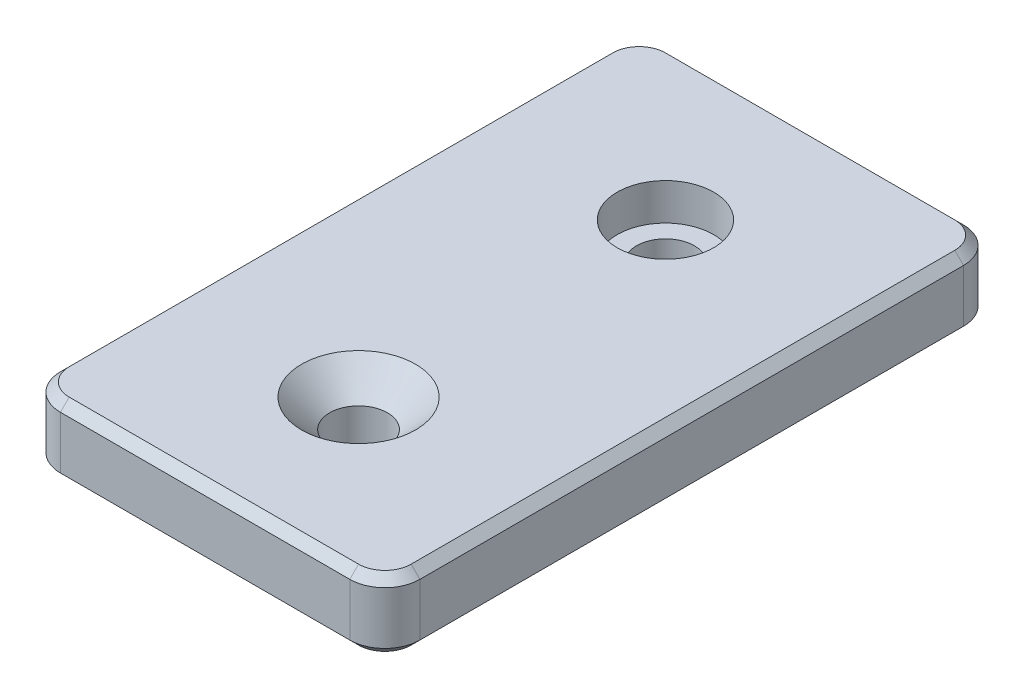
ISO-10303-21;
HEADER;
FILE_DESCRIPTION(('STEP AP214'),'2;1');
FILE_NAME('part.step','',(''),(''),'','','');
FILE_SCHEMA(('AUTOMOTIVE_DESIGN { 1 0 10303 214 1 1 1 1 }'));
ENDSEC;
DATA;
#1=APPLICATION_CONTEXT('core data for automotive mechanical design processes');
#2=APPLICATION_PROTOCOL_DEFINITION('international standard','automotive_design',2000,#1);
#3=PRODUCT_CONTEXT('',#1,'mechanical');
#4=PRODUCT('Part','Part','',(#3));
#5=PRODUCT_RELATED_PRODUCT_CATEGORY('part','',(#4));
#6=PRODUCT_DEFINITION_FORMATION('','',#4);
#7=PRODUCT_DEFINITION_CONTEXT('part definition',#1,'design');
#8=PRODUCT_DEFINITION('design','',#6,#7);
#9=PRODUCT_DEFINITION_SHAPE('','',#8);
#10=(LENGTH_UNIT() NAMED_UNIT(*) SI_UNIT(.MILLI.,.METRE.));
#11=(NAMED_UNIT(*) PLANE_ANGLE_UNIT() SI_UNIT($,.RADIAN.));
#12=(NAMED_UNIT(*) SI_UNIT($,.STERADIAN.) SOLID_ANGLE_UNIT());
#13=UNCERTAINTY_MEASURE_WITH_UNIT(LENGTH_MEASURE(1.E-05),#10,'distance_accuracy_value','');
#14=(GEOMETRIC_REPRESENTATION_CONTEXT(3) GLOBAL_UNCERTAINTY_ASSIGNED_CONTEXT((#13)) GLOBAL_UNIT_ASSIGNED_CONTEXT((#10,
#11,#12)) REPRESENTATION_CONTEXT('',''));
#15=CARTESIAN_POINT('',(0.,0.,0.));
#16=DIRECTION('',(0.,0.,1.));
#17=DIRECTION('',(1.,0.,0.));
#18=AXIS2_PLACEMENT_3D('',#15,#16,#17);
#19=CARTESIAN_POINT('',(0.,0.,-17.5));
#20=DIRECTION('',(0.,1.,0.));
#21=DIRECTION('',(0.,0.,1.));
#22=AXIS2_PLACEMENT_3D('',#19,#20,#21);
#23=CYLINDRICAL_SURFACE('',#22,3.3);
#24=CARTESIAN_POINT('',(0.,0.,-17.5));
#25=DIRECTION('',(0.,1.,0.));
#26=DIRECTION('',(0.,0.,1.));
#27=AXIS2_PLACEMENT_3D('',#24,#25,#26);
#28=CIRCLE('',#27,3.3);
#29=CARTESIAN_POINT('',(0.,0.,-14.2));
#30=VERTEX_POINT('',#29);
#31=EDGE_CURVE('E457',#30,#30,#28,.T.);
#32=ORIENTED_EDGE('',*,*,#31,.F.);
#33=EDGE_LOOP('',(#32));
#34=FACE_BOUND('',#33,.T.);
#35=CARTESIAN_POINT('',(0.,3.8,-17.5));
#36=DIRECTION('',(0.,1.,0.));
#37=DIRECTION('',(0.,0.,1.));
#38=AXIS2_PLACEMENT_3D('',#35,#36,#37);
#39=CIRCLE('',#38,3.3);
#40=CARTESIAN_POINT('',(0.,3.8,-14.2));
#41=VERTEX_POINT('',#40);
#42=EDGE_CURVE('E37',#41,#41,#39,.F.);
#43=ORIENTED_EDGE('',*,*,#42,.F.);
#44=EDGE_LOOP('',(#43));
#45=FACE_BOUND('',#44,.T.);
#46=ADVANCED_FACE('F33',(#34,#45),#23,.F.);
#47=CARTESIAN_POINT('',(20.5,8.,-35.));
#48=DIRECTION('',(-1.,0.,0.));
#49=DIRECTION('',(0.,0.,1.));
#50=AXIS2_PLACEMENT_3D('',#47,#48,#49);
#51=PLANE('',#50);
#52=DIRECTION('',(0.,-1.,0.));
#53=VECTOR('',#52,1.);
#54=CARTESIAN_POINT('',(20.5,8.,31.));
#55=LINE('',#54,#53);
#56=CARTESIAN_POINT('',(20.5,6.99999999999999,31.));
#57=VERTEX_POINT('',#56);
#58=CARTESIAN_POINT('',(20.5,0.999999999999983,31.));
#59=VERTEX_POINT('',#58);
#60=EDGE_CURVE('E427',#57,#59,#55,.T.);
#61=ORIENTED_EDGE('',*,*,#60,.T.);
#62=DIRECTION('',(0.,0.,-1.));
#63=VECTOR('',#62,1.);
#64=CARTESIAN_POINT('',(20.5,0.999999999999983,-35.));
#65=LINE('',#64,#63);
#66=CARTESIAN_POINT('',(20.5,0.999999999999983,-31.));
#67=VERTEX_POINT('',#66);
#68=EDGE_CURVE('E209',#59,#67,#65,.T.);
#69=ORIENTED_EDGE('',*,*,#68,.T.);
#70=DIRECTION('',(0.,-1.,0.));
#71=VECTOR('',#70,1.);
#72=CARTESIAN_POINT('',(20.5,8.,-31.));
#73=LINE('',#72,#71);
#74=CARTESIAN_POINT('',(20.5,6.99999999999999,-31.));
#75=VERTEX_POINT('',#74);
#76=EDGE_CURVE('E189',#67,#75,#73,.F.);
#77=ORIENTED_EDGE('',*,*,#76,.T.);
#78=DIRECTION('',(0.,0.,1.));
#79=VECTOR('',#78,1.);
#80=CARTESIAN_POINT('',(20.5,6.99999999999999,31.));
#81=LINE('',#80,#79);
#82=EDGE_CURVE('E171',#75,#57,#81,.T.);
#83=ORIENTED_EDGE('',*,*,#82,.T.);
#84=EDGE_LOOP('',(#61,#69,#77,#83));
#85=FACE_BOUND('',#84,.T.);
#86=ADVANCED_FACE('F305',(#85),#51,.F.);
#87=CARTESIAN_POINT('',(-20.5,8.,-35.));
#88=DIRECTION('',(0.,0.,1.));
#89=DIRECTION('',(1.,0.,0.));
#90=AXIS2_PLACEMENT_3D('',#87,#88,#89);
#91=PLANE('',#90);
#92=DIRECTION('',(0.,-1.,0.));
#93=VECTOR('',#92,1.);
#94=CARTESIAN_POINT('',(16.5,8.,-35.));
#95=LINE('',#94,#93);
#96=CARTESIAN_POINT('',(16.5,6.99999999999999,-35.));
#97=VERTEX_POINT('',#96);
#98=CARTESIAN_POINT('',(16.5,0.999999999999983,-35.));
#99=VERTEX_POINT('',#98);
#100=EDGE_CURVE('E418',#97,#99,#95,.T.);
#101=ORIENTED_EDGE('',*,*,#100,.T.);
#102=DIRECTION('',(-1.,0.,0.));
#103=VECTOR('',#102,1.);
#104=CARTESIAN_POINT('',(-20.5,0.999999999999983,-35.));
#105=LINE('',#104,#103);
#106=CARTESIAN_POINT('',(-16.5,0.999999999999983,-35.));
#107=VERTEX_POINT('',#106);
#108=EDGE_CURVE('E217',#99,#107,#105,.T.);
#109=ORIENTED_EDGE('',*,*,#108,.T.);
#110=DIRECTION('',(0.,-1.,0.));
#111=VECTOR('',#110,1.);
#112=CARTESIAN_POINT('',(-16.5,8.,-35.));
#113=LINE('',#112,#111);
#114=CARTESIAN_POINT('',(-16.5,6.99999999999999,-35.));
#115=VERTEX_POINT('',#114);
#116=EDGE_CURVE('E421',#107,#115,#113,.F.);
#117=ORIENTED_EDGE('',*,*,#116,.T.);
#118=DIRECTION('',(1.,0.,0.));
#119=VECTOR('',#118,1.);
#120=CARTESIAN_POINT('',(16.5,6.99999999999999,-35.));
#121=LINE('',#120,#119);
#122=EDGE_CURVE('E215',#115,#97,#121,.T.);
#123=ORIENTED_EDGE('',*,*,#122,.T.);
#124=EDGE_LOOP('',(#101,#109,#117,#123));
#125=FACE_BOUND('',#124,.T.);
#126=ADVANCED_FACE('F312',(#125),#91,.F.);
#127=CARTESIAN_POINT('',(-20.5,8.,-35.));
#128=DIRECTION('',(1.,0.,0.));
#129=DIRECTION('',(0.,0.,-1.));
#130=AXIS2_PLACEMENT_3D('',#127,#128,#129);
#131=PLANE('',#130);
#132=DIRECTION('',(0.,-1.,0.));
#133=VECTOR('',#132,1.);
#134=CARTESIAN_POINT('',(-20.5,8.,-31.));
#135=LINE('',#134,#133);
#136=CARTESIAN_POINT('',(-20.5,6.99999999999999,-31.));
#137=VERTEX_POINT('',#136);
#138=CARTESIAN_POINT('',(-20.5,0.999999999999983,-31.));
#139=VERTEX_POINT('',#138);
#140=EDGE_CURVE('E425',#137,#139,#135,.T.);
#141=ORIENTED_EDGE('',*,*,#140,.T.);
#142=DIRECTION('',(0.,0.,1.));
#143=VECTOR('',#142,1.);
#144=CARTESIAN_POINT('',(-20.5,0.999999999999983,-35.));
#145=LINE('',#144,#143);
#146=CARTESIAN_POINT('',(-20.5,0.999999999999983,31.));
#147=VERTEX_POINT('',#146);
#148=EDGE_CURVE('E225',#139,#147,#145,.T.);
#149=ORIENTED_EDGE('',*,*,#148,.T.);
#150=DIRECTION('',(0.,-1.,0.));
#151=VECTOR('',#150,1.);
#152=CARTESIAN_POINT('',(-20.5,8.,31.));
#153=LINE('',#152,#151);
#154=CARTESIAN_POINT('',(-20.5,6.99999999999999,31.));
#155=VERTEX_POINT('',#154);
#156=EDGE_CURVE('E263',#147,#155,#153,.F.);
#157=ORIENTED_EDGE('',*,*,#156,.T.);
#158=DIRECTION('',(0.,0.,-1.));
#159=VECTOR('',#158,1.);
#160=CARTESIAN_POINT('',(-20.5,6.99999999999999,-31.));
#161=LINE('',#160,#159);
#162=EDGE_CURVE('E223',#155,#137,#161,.T.);
#163=ORIENTED_EDGE('',*,*,#162,.T.);
#164=EDGE_LOOP('',(#141,#149,#157,#163));
#165=FACE_BOUND('',#164,.T.);
#166=ADVANCED_FACE('F330',(#165),#131,.F.);
#167=CARTESIAN_POINT('',(-20.5,8.,35.));
#168=DIRECTION('',(0.,0.,-1.));
#169=DIRECTION('',(-1.,0.,0.));
#170=AXIS2_PLACEMENT_3D('',#167,#168,#169);
#171=PLANE('',#170);
#172=DIRECTION('',(0.,-1.,0.));
#173=VECTOR('',#172,1.);
#174=CARTESIAN_POINT('',(-16.5,8.,35.));
#175=LINE('',#174,#173);
#176=CARTESIAN_POINT('',(-16.5,6.99999999999999,35.));
#177=VERTEX_POINT('',#176);
#178=CARTESIAN_POINT('',(-16.5,0.999999999999983,35.));
#179=VERTEX_POINT('',#178);
#180=EDGE_CURVE('E180',#177,#179,#175,.T.);
#181=ORIENTED_EDGE('',*,*,#180,.T.);
#182=DIRECTION('',(1.,0.,0.));
#183=VECTOR('',#182,1.);
#184=CARTESIAN_POINT('',(-20.5,0.999999999999983,35.));
#185=LINE('',#184,#183);
#186=CARTESIAN_POINT('',(16.5,0.999999999999983,35.));
#187=VERTEX_POINT('',#186);
#188=EDGE_CURVE('E154',#179,#187,#185,.T.);
#189=ORIENTED_EDGE('',*,*,#188,.T.);
#190=DIRECTION('',(0.,-1.,0.));
#191=VECTOR('',#190,1.);
#192=CARTESIAN_POINT('',(16.5,8.,35.));
#193=LINE('',#192,#191);
#194=CARTESIAN_POINT('',(16.5,6.99999999999999,35.));
#195=VERTEX_POINT('',#194);
#196=EDGE_CURVE('E178',#187,#195,#193,.F.);
#197=ORIENTED_EDGE('',*,*,#196,.T.);
#198=DIRECTION('',(-1.,0.,0.));
#199=VECTOR('',#198,1.);
#200=CARTESIAN_POINT('',(-16.5,6.99999999999999,35.));
#201=LINE('',#200,#199);
#202=EDGE_CURVE('E183',#195,#177,#201,.T.);
#203=ORIENTED_EDGE('',*,*,#202,.T.);
#204=EDGE_LOOP('',(#181,#189,#197,#203));
#205=FACE_BOUND('',#204,.T.);
#206=ADVANCED_FACE('F177',(#205),#171,.F.);
#207=CARTESIAN_POINT('',(0.,8.,0.));
#208=DIRECTION('',(0.,1.,0.));
#209=DIRECTION('',(0.,0.,1.));
#210=AXIS2_PLACEMENT_3D('',#207,#208,#209);
#211=PLANE('',#210);
#212=CARTESIAN_POINT('',(0.,8.,-17.5));
#213=DIRECTION('',(0.,1.,0.));
#214=DIRECTION('',(0.,0.,1.));
#215=AXIS2_PLACEMENT_3D('',#212,#213,#214);
#216=CIRCLE('',#215,5.5);
#217=CARTESIAN_POINT('',(0.,8.,-12.));
#218=VERTEX_POINT('',#217);
#219=EDGE_CURVE('E462',#218,#218,#216,.T.);
#220=ORIENTED_EDGE('',*,*,#219,.F.);
#221=EDGE_LOOP('',(#220));
#222=FACE_BOUND('',#221,.T.);
#223=CARTESIAN_POINT('',(0.,8.,17.5));
#224=DIRECTION('',(0.,1.,0.));
#225=DIRECTION('',(0.,0.,1.));
#226=AXIS2_PLACEMENT_3D('',#223,#224,#225);
#227=CIRCLE('',#226,6.50000000000001);
#228=CARTESIAN_POINT('',(0.,8.,24.));
#229=VERTEX_POINT('',#228);
#230=EDGE_CURVE('E11',#229,#229,#227,.F.);
#231=ORIENTED_EDGE('',*,*,#230,.T.);
#232=EDGE_LOOP('',(#231));
#233=FACE_BOUND('',#232,.T.);
#234=DIRECTION('',(1.,0.,0.));
#235=VECTOR('',#234,1.);
#236=CARTESIAN_POINT('',(16.5,8.,34.));
#237=LINE('',#236,#235);
#238=CARTESIAN_POINT('',(-16.5,8.,34.));
#239=VERTEX_POINT('',#238);
#240=CARTESIAN_POINT('',(16.5,8.,34.));
#241=VERTEX_POINT('',#240);
#242=EDGE_CURVE('E231',#239,#241,#237,.T.);
#243=ORIENTED_EDGE('',*,*,#242,.T.);
#244=CARTESIAN_POINT('',(16.5,8.,31.));
#245=DIRECTION('',(0.,1.,0.));
#246=DIRECTION('',(0.,0.,1.));
#247=AXIS2_PLACEMENT_3D('',#244,#245,#246);
#248=CIRCLE('',#247,3.00000000000001);
#249=CARTESIAN_POINT('',(19.5,8.,31.));
#250=VERTEX_POINT('',#249);
#251=EDGE_CURVE('E244',#241,#250,#248,.T.);
#252=ORIENTED_EDGE('',*,*,#251,.T.);
#253=DIRECTION('',(0.,0.,-1.));
#254=VECTOR('',#253,1.);
#255=CARTESIAN_POINT('',(19.5,8.,-31.));
#256=LINE('',#255,#254);
#257=CARTESIAN_POINT('',(19.5,8.,-31.));
#258=VERTEX_POINT('',#257);
#259=EDGE_CURVE('E56',#250,#258,#256,.T.);
#260=ORIENTED_EDGE('',*,*,#259,.T.);
#261=CARTESIAN_POINT('',(16.5,8.,-31.));
#262=DIRECTION('',(0.,1.,0.));
#263=DIRECTION('',(0.,0.,1.));
#264=AXIS2_PLACEMENT_3D('',#261,#262,#263);
#265=CIRCLE('',#264,3.00000000000001);
#266=CARTESIAN_POINT('',(16.5,8.,-34.));
#267=VERTEX_POINT('',#266);
#268=EDGE_CURVE('E241',#258,#267,#265,.T.);
#269=ORIENTED_EDGE('',*,*,#268,.T.);
#270=DIRECTION('',(-1.,0.,0.));
#271=VECTOR('',#270,1.);
#272=CARTESIAN_POINT('',(-16.5,8.,-34.));
#273=LINE('',#272,#271);
#274=CARTESIAN_POINT('',(-16.5,8.,-34.));
#275=VERTEX_POINT('',#274);
#276=EDGE_CURVE('E239',#267,#275,#273,.T.);
#277=ORIENTED_EDGE('',*,*,#276,.T.);
#278=CARTESIAN_POINT('',(-16.5,8.,-31.));
#279=DIRECTION('',(0.,1.,0.));
#280=DIRECTION('',(0.,0.,1.));
#281=AXIS2_PLACEMENT_3D('',#278,#279,#280);
#282=CIRCLE('',#281,3.00000000000001);
#283=CARTESIAN_POINT('',(-19.5,8.,-31.));
#284=VERTEX_POINT('',#283);
#285=EDGE_CURVE('E237',#275,#284,#282,.T.);
#286=ORIENTED_EDGE('',*,*,#285,.T.);
#287=DIRECTION('',(0.,0.,1.));
#288=VECTOR('',#287,1.);
#289=CARTESIAN_POINT('',(-19.5,8.,31.));
#290=LINE('',#289,#288);
#291=CARTESIAN_POINT('',(-19.5,8.,31.));
#292=VERTEX_POINT('',#291);
#293=EDGE_CURVE('E235',#284,#292,#290,.T.);
#294=ORIENTED_EDGE('',*,*,#293,.T.);
#295=CARTESIAN_POINT('',(-16.5,8.,31.));
#296=DIRECTION('',(0.,1.,0.));
#297=DIRECTION('',(0.,0.,1.));
#298=AXIS2_PLACEMENT_3D('',#295,#296,#297);
#299=CIRCLE('',#298,3.00000000000001);
#300=EDGE_CURVE('E233',#292,#239,#299,.T.);
#301=ORIENTED_EDGE('',*,*,#300,.T.);
#302=EDGE_LOOP('',(#243,#252,#260,#269,#277,#286,#294,#301));
#303=FACE_BOUND('',#302,.T.);
#304=ADVANCED_FACE('F319',(#222,#233,#303),#211,.T.);
#305=CARTESIAN_POINT('',(0.,0.,0.));
#306=DIRECTION('',(0.,1.,0.));
#307=DIRECTION('',(0.,0.,1.));
#308=AXIS2_PLACEMENT_3D('',#305,#306,#307);
#309=PLANE('',#308);
#310=CARTESIAN_POINT('',(0.,0.,17.5));
#311=DIRECTION('',(0.,1.,0.));
#312=DIRECTION('',(0.,0.,1.));
#313=AXIS2_PLACEMENT_3D('',#310,#311,#312);
#314=CIRCLE('',#313,3.3);
#315=CARTESIAN_POINT('',(0.,0.,20.8));
#316=VERTEX_POINT('',#315);
#317=EDGE_CURVE('E266',#316,#316,#314,.T.);
#318=ORIENTED_EDGE('',*,*,#317,.T.);
#319=EDGE_LOOP('',(#318));
#320=FACE_BOUND('',#319,.T.);
#321=ORIENTED_EDGE('',*,*,#31,.T.);
#322=EDGE_LOOP('',(#321));
#323=FACE_BOUND('',#322,.T.);
#324=CARTESIAN_POINT('',(16.5,0.,31.));
#325=DIRECTION('',(0.,1.,0.));
#326=DIRECTION('',(0.,0.,1.));
#327=AXIS2_PLACEMENT_3D('',#324,#325,#326);
#328=CIRCLE('',#327,3.00000000000002);
#329=CARTESIAN_POINT('',(19.5,0.,31.));
#330=VERTEX_POINT('',#329);
#331=CARTESIAN_POINT('',(16.5,0.,34.));
#332=VERTEX_POINT('',#331);
#333=EDGE_CURVE('E204',#330,#332,#328,.F.);
#334=ORIENTED_EDGE('',*,*,#333,.T.);
#335=DIRECTION('',(-1.,0.,0.));
#336=VECTOR('',#335,1.);
#337=CARTESIAN_POINT('',(0.,0.,34.));
#338=LINE('',#337,#336);
#339=CARTESIAN_POINT('',(-16.5,0.,34.));
#340=VERTEX_POINT('',#339);
#341=EDGE_CURVE('E156',#332,#340,#338,.T.);
#342=ORIENTED_EDGE('',*,*,#341,.T.);
#343=CARTESIAN_POINT('',(-16.5,0.,31.));
#344=DIRECTION('',(0.,1.,0.));
#345=DIRECTION('',(0.,0.,1.));
#346=AXIS2_PLACEMENT_3D('',#343,#344,#345);
#347=CIRCLE('',#346,3.00000000000002);
#348=CARTESIAN_POINT('',(-19.5,0.,31.));
#349=VERTEX_POINT('',#348);
#350=EDGE_CURVE('E182',#340,#349,#347,.F.);
#351=ORIENTED_EDGE('',*,*,#350,.T.);
#352=DIRECTION('',(0.,0.,-1.));
#353=VECTOR('',#352,1.);
#354=CARTESIAN_POINT('',(-19.5,0.,0.));
#355=LINE('',#354,#353);
#356=CARTESIAN_POINT('',(-19.5,0.,-31.));
#357=VERTEX_POINT('',#356);
#358=EDGE_CURVE('E194',#349,#357,#355,.T.);
#359=ORIENTED_EDGE('',*,*,#358,.T.);
#360=CARTESIAN_POINT('',(-16.5,0.,-31.));
#361=DIRECTION('',(0.,1.,0.));
#362=DIRECTION('',(0.,0.,1.));
#363=AXIS2_PLACEMENT_3D('',#360,#361,#362);
#364=CIRCLE('',#363,3.00000000000001);
#365=CARTESIAN_POINT('',(-16.5,0.,-34.));
#366=VERTEX_POINT('',#365);
#367=EDGE_CURVE('E196',#357,#366,#364,.F.);
#368=ORIENTED_EDGE('',*,*,#367,.T.);
#369=DIRECTION('',(1.,0.,0.));
#370=VECTOR('',#369,1.);
#371=CARTESIAN_POINT('',(0.,0.,-34.));
#372=LINE('',#371,#370);
#373=CARTESIAN_POINT('',(16.5,0.,-34.));
#374=VERTEX_POINT('',#373);
#375=EDGE_CURVE('E198',#366,#374,#372,.T.);
#376=ORIENTED_EDGE('',*,*,#375,.T.);
#377=CARTESIAN_POINT('',(16.5,0.,-31.));
#378=DIRECTION('',(0.,1.,0.));
#379=DIRECTION('',(0.,0.,1.));
#380=AXIS2_PLACEMENT_3D('',#377,#378,#379);
#381=CIRCLE('',#380,3.00000000000002);
#382=CARTESIAN_POINT('',(19.5,0.,-31.));
#383=VERTEX_POINT('',#382);
#384=EDGE_CURVE('E200',#374,#383,#381,.F.);
#385=ORIENTED_EDGE('',*,*,#384,.T.);
#386=DIRECTION('',(0.,0.,1.));
#387=VECTOR('',#386,1.);
#388=CARTESIAN_POINT('',(19.5,0.,0.));
#389=LINE('',#388,#387);
#390=EDGE_CURVE('E202',#383,#330,#389,.T.);
#391=ORIENTED_EDGE('',*,*,#390,.T.);
#392=EDGE_LOOP('',(#334,#342,#351,#359,#368,#376,#385,#391));
#393=FACE_BOUND('',#392,.T.);
#394=ADVANCED_FACE('F322',(#320,#323,#393),#309,.F.);
#395=CARTESIAN_POINT('',(-16.5,8.,-31.));
#396=DIRECTION('',(0.,-1.,0.));
#397=DIRECTION('',(0.,0.,-1.));
#398=AXIS2_PLACEMENT_3D('',#395,#396,#397);
#399=CYLINDRICAL_SURFACE('',#398,4.);
#400=ORIENTED_EDGE('',*,*,#116,.F.);
#401=CARTESIAN_POINT('',(-16.5,0.999999999999983,-31.));
#402=DIRECTION('',(0.,1.,0.));
#403=DIRECTION('',(0.,0.,1.));
#404=AXIS2_PLACEMENT_3D('',#401,#402,#403);
#405=CIRCLE('',#404,4.);
#406=EDGE_CURVE('E221',#107,#139,#405,.T.);
#407=ORIENTED_EDGE('',*,*,#406,.T.);
#408=ORIENTED_EDGE('',*,*,#140,.F.);
#409=CARTESIAN_POINT('',(-16.5,6.99999999999999,-31.));
#410=DIRECTION('',(0.,1.,0.));
#411=DIRECTION('',(0.,0.,1.));
#412=AXIS2_PLACEMENT_3D('',#409,#410,#411);
#413=CIRCLE('',#412,4.);
#414=EDGE_CURVE('E219',#137,#115,#413,.F.);
#415=ORIENTED_EDGE('',*,*,#414,.T.);
#416=EDGE_LOOP('',(#400,#407,#408,#415));
#417=FACE_BOUND('',#416,.T.);
#418=ADVANCED_FACE('F326',(#417),#399,.T.);
#419=CARTESIAN_POINT('',(16.5,8.,-31.));
#420=DIRECTION('',(0.,-1.,0.));
#421=DIRECTION('',(0.,0.,-1.));
#422=AXIS2_PLACEMENT_3D('',#419,#420,#421);
#423=CYLINDRICAL_SURFACE('',#422,4.);
#424=ORIENTED_EDGE('',*,*,#76,.F.);
#425=CARTESIAN_POINT('',(16.5,0.999999999999983,-31.));
#426=DIRECTION('',(0.,1.,0.));
#427=DIRECTION('',(0.,0.,1.));
#428=AXIS2_PLACEMENT_3D('',#425,#426,#427);
#429=CIRCLE('',#428,4.);
#430=EDGE_CURVE('E213',#67,#99,#429,.T.);
#431=ORIENTED_EDGE('',*,*,#430,.T.);
#432=ORIENTED_EDGE('',*,*,#100,.F.);
#433=CARTESIAN_POINT('',(16.5,6.99999999999999,-31.));
#434=DIRECTION('',(0.,1.,0.));
#435=DIRECTION('',(0.,0.,1.));
#436=AXIS2_PLACEMENT_3D('',#433,#434,#435);
#437=CIRCLE('',#436,4.);
#438=EDGE_CURVE('E211',#97,#75,#437,.F.);
#439=ORIENTED_EDGE('',*,*,#438,.T.);
#440=EDGE_LOOP('',(#424,#431,#432,#439));
#441=FACE_BOUND('',#440,.T.);
#442=ADVANCED_FACE('F339',(#441),#423,.T.);
#443=CARTESIAN_POINT('',(16.5,8.,31.));
#444=DIRECTION('',(0.,-1.,0.));
#445=DIRECTION('',(0.,0.,-1.));
#446=AXIS2_PLACEMENT_3D('',#443,#444,#445);
#447=CYLINDRICAL_SURFACE('',#446,4.);
#448=ORIENTED_EDGE('',*,*,#196,.F.);
#449=CARTESIAN_POINT('',(16.5,0.999999999999983,31.));
#450=DIRECTION('',(0.,1.,0.));
#451=DIRECTION('',(0.,0.,1.));
#452=AXIS2_PLACEMENT_3D('',#449,#450,#451);
#453=CIRCLE('',#452,4.);
#454=EDGE_CURVE('E163',#187,#59,#453,.T.);
#455=ORIENTED_EDGE('',*,*,#454,.T.);
#456=ORIENTED_EDGE('',*,*,#60,.F.);
#457=CARTESIAN_POINT('',(16.5,6.99999999999999,31.));
#458=DIRECTION('',(0.,1.,0.));
#459=DIRECTION('',(0.,0.,1.));
#460=AXIS2_PLACEMENT_3D('',#457,#458,#459);
#461=CIRCLE('',#460,4.);
#462=EDGE_CURVE('E172',#57,#195,#461,.F.);
#463=ORIENTED_EDGE('',*,*,#462,.T.);
#464=EDGE_LOOP('',(#448,#455,#456,#463));
#465=FACE_BOUND('',#464,.T.);
#466=ADVANCED_FACE('F186',(#465),#447,.T.);
#467=CARTESIAN_POINT('',(-16.5,8.,31.));
#468=DIRECTION('',(0.,-1.,0.));
#469=DIRECTION('',(0.,0.,-1.));
#470=AXIS2_PLACEMENT_3D('',#467,#468,#469);
#471=CYLINDRICAL_SURFACE('',#470,4.);
#472=ORIENTED_EDGE('',*,*,#156,.F.);
#473=CARTESIAN_POINT('',(-16.5,0.999999999999983,31.));
#474=DIRECTION('',(0.,1.,0.));
#475=DIRECTION('',(0.,0.,1.));
#476=AXIS2_PLACEMENT_3D('',#473,#474,#475);
#477=CIRCLE('',#476,4.);
#478=EDGE_CURVE('E229',#147,#179,#477,.T.);
#479=ORIENTED_EDGE('',*,*,#478,.T.);
#480=ORIENTED_EDGE('',*,*,#180,.F.);
#481=CARTESIAN_POINT('',(-16.5,6.99999999999999,31.));
#482=DIRECTION('',(0.,1.,0.));
#483=DIRECTION('',(0.,0.,1.));
#484=AXIS2_PLACEMENT_3D('',#481,#482,#483);
#485=CIRCLE('',#484,4.);
#486=EDGE_CURVE('E227',#177,#155,#485,.F.);
#487=ORIENTED_EDGE('',*,*,#486,.T.);
#488=EDGE_LOOP('',(#472,#479,#480,#487));
#489=FACE_BOUND('',#488,.T.);
#490=ADVANCED_FACE('F346',(#489),#471,.T.);
#491=CARTESIAN_POINT('',(-20.5,0.999999999999983,-35.));
#492=DIRECTION('',(0.,0.707106781186549,0.707106781186546));
#493=DIRECTION('',(-1.,0.,0.));
#494=AXIS2_PLACEMENT_3D('',#491,#492,#493);
#495=PLANE('',#494);
#496=DIRECTION('',(0.,0.707106781186546,-0.707106781186549));
#497=VECTOR('',#496,1.);
#498=CARTESIAN_POINT('',(16.5,0.,-34.));
#499=LINE('',#498,#497);
#500=EDGE_CURVE('E257',#374,#99,#499,.T.);
#501=ORIENTED_EDGE('',*,*,#500,.F.);
#502=ORIENTED_EDGE('',*,*,#375,.F.);
#503=DIRECTION('',(0.,-0.707106781186546,0.707106781186549));
#504=VECTOR('',#503,1.);
#505=CARTESIAN_POINT('',(-16.5,0.999999999999983,-35.));
#506=LINE('',#505,#504);
#507=EDGE_CURVE('E260',#107,#366,#506,.T.);
#508=ORIENTED_EDGE('',*,*,#507,.F.);
#509=ORIENTED_EDGE('',*,*,#108,.F.);
#510=EDGE_LOOP('',(#501,#502,#508,#509));
#511=FACE_BOUND('',#510,.T.);
#512=ADVANCED_FACE('F349',(#511),#495,.F.);
#513=CARTESIAN_POINT('',(-16.5,0.,-31.));
#514=DIRECTION('',(0.,1.,0.));
#515=DIRECTION('',(0.,0.,1.));
#516=AXIS2_PLACEMENT_3D('',#513,#514,#515);
#517=CONICAL_SURFACE('',#516,3.00000000000001,0.78539816339745);
#518=ORIENTED_EDGE('',*,*,#507,.T.);
#519=ORIENTED_EDGE('',*,*,#367,.F.);
#520=DIRECTION('',(0.707106781186549,-0.707106781186546,0.));
#521=VECTOR('',#520,1.);
#522=CARTESIAN_POINT('',(-20.5,0.999999999999983,-31.));
#523=LINE('',#522,#521);
#524=EDGE_CURVE('E254',#139,#357,#523,.T.);
#525=ORIENTED_EDGE('',*,*,#524,.F.);
#526=ORIENTED_EDGE('',*,*,#406,.F.);
#527=EDGE_LOOP('',(#518,#519,#525,#526));
#528=FACE_BOUND('',#527,.T.);
#529=ADVANCED_FACE('F371',(#528),#517,.T.);
#530=CARTESIAN_POINT('',(16.5,0.,-31.));
#531=DIRECTION('',(0.,1.,0.));
#532=DIRECTION('',(0.,0.,1.));
#533=AXIS2_PLACEMENT_3D('',#530,#531,#532);
#534=CONICAL_SURFACE('',#533,3.00000000000002,0.785398163397449);
#535=ORIENTED_EDGE('',*,*,#500,.T.);
#536=ORIENTED_EDGE('',*,*,#430,.F.);
#537=DIRECTION('',(0.707106781186548,0.707106781186547,0.));
#538=VECTOR('',#537,1.);
#539=CARTESIAN_POINT('',(19.5,0.,-31.));
#540=LINE('',#539,#538);
#541=EDGE_CURVE('E251',#383,#67,#540,.T.);
#542=ORIENTED_EDGE('',*,*,#541,.F.);
#543=ORIENTED_EDGE('',*,*,#384,.F.);
#544=EDGE_LOOP('',(#535,#536,#542,#543));
#545=FACE_BOUND('',#544,.T.);
#546=ADVANCED_FACE('F367',(#545),#534,.T.);
#547=CARTESIAN_POINT('',(-20.5,0.999999999999983,-35.));
#548=DIRECTION('',(0.707106781186547,0.707106781186548,0.));
#549=DIRECTION('',(0.,0.,1.));
#550=AXIS2_PLACEMENT_3D('',#547,#548,#549);
#551=PLANE('',#550);
#552=ORIENTED_EDGE('',*,*,#524,.T.);
#553=ORIENTED_EDGE('',*,*,#358,.F.);
#554=DIRECTION('',(0.707106781186548,-0.707106781186547,0.));
#555=VECTOR('',#554,1.);
#556=CARTESIAN_POINT('',(-20.5,0.999999999999983,31.));
#557=LINE('',#556,#555);
#558=EDGE_CURVE('E248',#147,#349,#557,.T.);
#559=ORIENTED_EDGE('',*,*,#558,.F.);
#560=ORIENTED_EDGE('',*,*,#148,.F.);
#561=EDGE_LOOP('',(#552,#553,#559,#560));
#562=FACE_BOUND('',#561,.T.);
#563=ADVANCED_FACE('F363',(#562),#551,.F.);
#564=CARTESIAN_POINT('',(20.5,0.999999999999983,-35.));
#565=DIRECTION('',(-0.707106781186547,0.707106781186548,0.));
#566=DIRECTION('',(0.,0.,-1.));
#567=AXIS2_PLACEMENT_3D('',#564,#565,#566);
#568=PLANE('',#567);
#569=ORIENTED_EDGE('',*,*,#541,.T.);
#570=ORIENTED_EDGE('',*,*,#68,.F.);
#571=DIRECTION('',(0.707106781186548,0.707106781186547,0.));
#572=VECTOR('',#571,1.);
#573=CARTESIAN_POINT('',(19.5,0.,31.));
#574=LINE('',#573,#572);
#575=EDGE_CURVE('E166',#330,#59,#574,.T.);
#576=ORIENTED_EDGE('',*,*,#575,.F.);
#577=ORIENTED_EDGE('',*,*,#390,.F.);
#578=EDGE_LOOP('',(#569,#570,#576,#577));
#579=FACE_BOUND('',#578,.T.);
#580=ADVANCED_FACE('F359',(#579),#568,.F.);
#581=CARTESIAN_POINT('',(-16.5,0.,31.));
#582=DIRECTION('',(0.,1.,0.));
#583=DIRECTION('',(0.,0.,1.));
#584=AXIS2_PLACEMENT_3D('',#581,#582,#583);
#585=CONICAL_SURFACE('',#584,3.00000000000002,0.785398163397449);
#586=ORIENTED_EDGE('',*,*,#558,.T.);
#587=ORIENTED_EDGE('',*,*,#350,.F.);
#588=DIRECTION('',(0.,-0.707106781186546,-0.707106781186549));
#589=VECTOR('',#588,1.);
#590=CARTESIAN_POINT('',(-16.5,0.999999999999983,35.));
#591=LINE('',#590,#589);
#592=EDGE_CURVE('E159',#179,#340,#591,.T.);
#593=ORIENTED_EDGE('',*,*,#592,.F.);
#594=ORIENTED_EDGE('',*,*,#478,.F.);
#595=EDGE_LOOP('',(#586,#587,#593,#594));
#596=FACE_BOUND('',#595,.T.);
#597=ADVANCED_FACE('F356',(#596),#585,.T.);
#598=CARTESIAN_POINT('',(16.5,0.,31.));
#599=DIRECTION('',(0.,1.,0.));
#600=DIRECTION('',(0.,0.,1.));
#601=AXIS2_PLACEMENT_3D('',#598,#599,#600);
#602=CONICAL_SURFACE('',#601,3.00000000000002,0.785398163397449);
#603=ORIENTED_EDGE('',*,*,#575,.T.);
#604=ORIENTED_EDGE('',*,*,#454,.F.);
#605=DIRECTION('',(0.,0.707106781186546,0.707106781186549));
#606=VECTOR('',#605,1.);
#607=CARTESIAN_POINT('',(16.5,0.,34.));
#608=LINE('',#607,#606);
#609=EDGE_CURVE('E150',#332,#187,#608,.T.);
#610=ORIENTED_EDGE('',*,*,#609,.F.);
#611=ORIENTED_EDGE('',*,*,#333,.F.);
#612=EDGE_LOOP('',(#603,#604,#610,#611));
#613=FACE_BOUND('',#612,.T.);
#614=ADVANCED_FACE('F164',(#613),#602,.T.);
#615=CARTESIAN_POINT('',(-20.5,0.999999999999983,35.));
#616=DIRECTION('',(0.,0.707106781186549,-0.707106781186546));
#617=DIRECTION('',(1.,0.,0.));
#618=AXIS2_PLACEMENT_3D('',#615,#616,#617);
#619=PLANE('',#618);
#620=ORIENTED_EDGE('',*,*,#592,.T.);
#621=ORIENTED_EDGE('',*,*,#341,.F.);
#622=ORIENTED_EDGE('',*,*,#609,.T.);
#623=ORIENTED_EDGE('',*,*,#188,.F.);
#624=EDGE_LOOP('',(#620,#621,#622,#623));
#625=FACE_BOUND('',#624,.T.);
#626=ADVANCED_FACE('F152',(#625),#619,.F.);
#627=CARTESIAN_POINT('',(-16.5,8.,-31.));
#628=DIRECTION('',(0.,-1.,0.));
#629=DIRECTION('',(0.,0.,-1.));
#630=AXIS2_PLACEMENT_3D('',#627,#628,#629);
#631=CONICAL_SURFACE('',#630,3.00000000000001,0.785398163397441);
#632=DIRECTION('',(0.,0.707106781186552,0.707106781186543));
#633=VECTOR('',#632,1.);
#634=CARTESIAN_POINT('',(-16.5,6.99999999999999,-35.));
#635=LINE('',#634,#633);
#636=EDGE_CURVE('E280',#115,#275,#635,.T.);
#637=ORIENTED_EDGE('',*,*,#636,.F.);
#638=ORIENTED_EDGE('',*,*,#414,.F.);
#639=DIRECTION('',(-0.707106781186543,-0.707106781186552,0.));
#640=VECTOR('',#639,1.);
#641=CARTESIAN_POINT('',(-19.5,8.,-31.));
#642=LINE('',#641,#640);
#643=EDGE_CURVE('E160',#284,#137,#642,.T.);
#644=ORIENTED_EDGE('',*,*,#643,.F.);
#645=ORIENTED_EDGE('',*,*,#285,.F.);
#646=EDGE_LOOP('',(#637,#638,#644,#645));
#647=FACE_BOUND('',#646,.T.);
#648=ADVANCED_FACE('F353',(#647),#631,.T.);
#649=CARTESIAN_POINT('',(-19.5,8.,0.));
#650=DIRECTION('',(-0.707106781186552,0.707106781186543,0.));
#651=DIRECTION('',(0.,0.,-1.));
#652=AXIS2_PLACEMENT_3D('',#649,#650,#651);
#653=PLANE('',#652);
#654=ORIENTED_EDGE('',*,*,#643,.T.);
#655=ORIENTED_EDGE('',*,*,#162,.F.);
#656=DIRECTION('',(-0.707106781186543,-0.707106781186552,0.));
#657=VECTOR('',#656,1.);
#658=CARTESIAN_POINT('',(-19.5,8.,31.));
#659=LINE('',#658,#657);
#660=EDGE_CURVE('E277',#292,#155,#659,.T.);
#661=ORIENTED_EDGE('',*,*,#660,.F.);
#662=ORIENTED_EDGE('',*,*,#293,.F.);
#663=EDGE_LOOP('',(#654,#655,#661,#662));
#664=FACE_BOUND('',#663,.T.);
#665=ADVANCED_FACE('F399',(#664),#653,.T.);
#666=CARTESIAN_POINT('',(0.,8.,-34.));
#667=DIRECTION('',(0.,0.707106781186543,-0.707106781186552));
#668=DIRECTION('',(1.,0.,0.));
#669=AXIS2_PLACEMENT_3D('',#666,#667,#668);
#670=PLANE('',#669);
#671=ORIENTED_EDGE('',*,*,#636,.T.);
#672=ORIENTED_EDGE('',*,*,#276,.F.);
#673=DIRECTION('',(0.,0.707106781186552,0.707106781186543));
#674=VECTOR('',#673,1.);
#675=CARTESIAN_POINT('',(16.5,6.99999999999999,-35.));
#676=LINE('',#675,#674);
#677=EDGE_CURVE('E274',#97,#267,#676,.T.);
#678=ORIENTED_EDGE('',*,*,#677,.F.);
#679=ORIENTED_EDGE('',*,*,#122,.F.);
#680=EDGE_LOOP('',(#671,#672,#678,#679));
#681=FACE_BOUND('',#680,.T.);
#682=ADVANCED_FACE('F395',(#681),#670,.T.);
#683=CARTESIAN_POINT('',(-16.5,8.,31.));
#684=DIRECTION('',(0.,-1.,0.));
#685=DIRECTION('',(0.,0.,-1.));
#686=AXIS2_PLACEMENT_3D('',#683,#684,#685);
#687=CONICAL_SURFACE('',#686,3.00000000000001,0.785398163397441);
#688=ORIENTED_EDGE('',*,*,#660,.T.);
#689=ORIENTED_EDGE('',*,*,#486,.F.);
#690=DIRECTION('',(0.,-0.707106781186552,0.707106781186543));
#691=VECTOR('',#690,1.);
#692=CARTESIAN_POINT('',(-16.5,8.,34.));
#693=LINE('',#692,#691);
#694=EDGE_CURVE('E271',#239,#177,#693,.T.);
#695=ORIENTED_EDGE('',*,*,#694,.F.);
#696=ORIENTED_EDGE('',*,*,#300,.F.);
#697=EDGE_LOOP('',(#688,#689,#695,#696));
#698=FACE_BOUND('',#697,.T.);
#699=ADVANCED_FACE('F391',(#698),#687,.T.);
#700=CARTESIAN_POINT('',(16.5,8.,-31.));
#701=DIRECTION('',(0.,-1.,0.));
#702=DIRECTION('',(0.,0.,-1.));
#703=AXIS2_PLACEMENT_3D('',#700,#701,#702);
#704=CONICAL_SURFACE('',#703,3.00000000000001,0.785398163397441);
#705=ORIENTED_EDGE('',*,*,#677,.T.);
#706=ORIENTED_EDGE('',*,*,#268,.F.);
#707=DIRECTION('',(-0.707106781186543,0.707106781186552,0.));
#708=VECTOR('',#707,1.);
#709=CARTESIAN_POINT('',(20.5,6.99999999999999,-31.));
#710=LINE('',#709,#708);
#711=EDGE_CURVE('E268',#75,#258,#710,.T.);
#712=ORIENTED_EDGE('',*,*,#711,.F.);
#713=ORIENTED_EDGE('',*,*,#438,.F.);
#714=EDGE_LOOP('',(#705,#706,#712,#713));
#715=FACE_BOUND('',#714,.T.);
#716=ADVANCED_FACE('F387',(#715),#704,.T.);
#717=CARTESIAN_POINT('',(0.,8.,34.));
#718=DIRECTION('',(0.,0.707106781186543,0.707106781186552));
#719=DIRECTION('',(-1.,0.,0.));
#720=AXIS2_PLACEMENT_3D('',#717,#718,#719);
#721=PLANE('',#720);
#722=ORIENTED_EDGE('',*,*,#694,.T.);
#723=ORIENTED_EDGE('',*,*,#202,.F.);
#724=DIRECTION('',(0.,-0.707106781186552,0.707106781186543));
#725=VECTOR('',#724,1.);
#726=CARTESIAN_POINT('',(16.5,8.,34.));
#727=LINE('',#726,#725);
#728=EDGE_CURVE('E265',#241,#195,#727,.T.);
#729=ORIENTED_EDGE('',*,*,#728,.F.);
#730=ORIENTED_EDGE('',*,*,#242,.F.);
#731=EDGE_LOOP('',(#722,#723,#729,#730));
#732=FACE_BOUND('',#731,.T.);
#733=ADVANCED_FACE('F383',(#732),#721,.T.);
#734=CARTESIAN_POINT('',(19.5,8.,0.));
#735=DIRECTION('',(0.707106781186552,0.707106781186543,0.));
#736=DIRECTION('',(0.,0.,1.));
#737=AXIS2_PLACEMENT_3D('',#734,#735,#736);
#738=PLANE('',#737);
#739=ORIENTED_EDGE('',*,*,#711,.T.);
#740=ORIENTED_EDGE('',*,*,#259,.F.);
#741=DIRECTION('',(-0.707106781186543,0.707106781186552,0.));
#742=VECTOR('',#741,1.);
#743=CARTESIAN_POINT('',(20.5,6.99999999999999,31.));
#744=LINE('',#743,#742);
#745=EDGE_CURVE('E49',#57,#250,#744,.T.);
#746=ORIENTED_EDGE('',*,*,#745,.F.);
#747=ORIENTED_EDGE('',*,*,#82,.F.);
#748=EDGE_LOOP('',(#739,#740,#746,#747));
#749=FACE_BOUND('',#748,.T.);
#750=ADVANCED_FACE('F380',(#749),#738,.T.);
#751=CARTESIAN_POINT('',(16.5,8.,31.));
#752=DIRECTION('',(0.,-1.,0.));
#753=DIRECTION('',(0.,0.,-1.));
#754=AXIS2_PLACEMENT_3D('',#751,#752,#753);
#755=CONICAL_SURFACE('',#754,3.00000000000001,0.78539816339744);
#756=ORIENTED_EDGE('',*,*,#728,.T.);
#757=ORIENTED_EDGE('',*,*,#462,.F.);
#758=ORIENTED_EDGE('',*,*,#745,.T.);
#759=ORIENTED_EDGE('',*,*,#251,.F.);
#760=EDGE_LOOP('',(#756,#757,#758,#759));
#761=FACE_BOUND('',#760,.T.);
#762=ADVANCED_FACE('F301',(#761),#755,.T.);
#763=CARTESIAN_POINT('',(0.,0.,17.5));
#764=DIRECTION('',(0.,1.,0.));
#765=DIRECTION('',(0.,0.,1.));
#766=AXIS2_PLACEMENT_3D('',#763,#764,#765);
#767=CYLINDRICAL_SURFACE('',#766,3.3);
#768=CARTESIAN_POINT('',(0.,4.80000000000001,17.5));
#769=DIRECTION('',(0.,1.,0.));
#770=DIRECTION('',(0.,0.,1.));
#771=AXIS2_PLACEMENT_3D('',#768,#769,#770);
#772=CIRCLE('',#771,3.3);
#773=CARTESIAN_POINT('',(0.,4.80000000000001,20.8));
#774=VERTEX_POINT('',#773);
#775=EDGE_CURVE('E42',#774,#774,#772,.T.);
#776=ORIENTED_EDGE('',*,*,#775,.T.);
#777=EDGE_LOOP('',(#776));
#778=FACE_BOUND('',#777,.T.);
#779=ORIENTED_EDGE('',*,*,#317,.F.);
#780=EDGE_LOOP('',(#779));
#781=FACE_BOUND('',#780,.T.);
#782=ADVANCED_FACE('F288',(#778,#781),#767,.F.);
#783=CARTESIAN_POINT('',(0.,4.80000000000001,17.5));
#784=DIRECTION('',(0.,1.,0.));
#785=DIRECTION('',(0.,0.,1.));
#786=AXIS2_PLACEMENT_3D('',#783,#784,#785);
#787=CONICAL_SURFACE('',#786,3.3,0.785398163397451);
#788=ORIENTED_EDGE('',*,*,#230,.F.);
#789=EDGE_LOOP('',(#788));
#790=FACE_BOUND('',#789,.T.);
#791=ORIENTED_EDGE('',*,*,#775,.F.);
#792=EDGE_LOOP('',(#791));
#793=FACE_BOUND('',#792,.T.);
#794=ADVANCED_FACE('F35',(#790,#793),#787,.F.);
#795=CARTESIAN_POINT('',(0.,3.8,-17.5));
#796=DIRECTION('',(0.,1.,0.));
#797=DIRECTION('',(0.,0.,1.));
#798=AXIS2_PLACEMENT_3D('',#795,#796,#797);
#799=PLANE('',#798);
#800=CARTESIAN_POINT('',(0.,3.8,-17.5));
#801=DIRECTION('',(0.,1.,0.));
#802=DIRECTION('',(0.,0.,1.));
#803=AXIS2_PLACEMENT_3D('',#800,#801,#802);
#804=CIRCLE('',#803,5.5);
#805=CARTESIAN_POINT('',(0.,3.8,-12.));
#806=VERTEX_POINT('',#805);
#807=EDGE_CURVE('E465',#806,#806,#804,.T.);
#808=ORIENTED_EDGE('',*,*,#807,.T.);
#809=EDGE_LOOP('',(#808));
#810=FACE_BOUND('',#809,.T.);
#811=ORIENTED_EDGE('',*,*,#42,.T.);
#812=EDGE_LOOP('',(#811));
#813=FACE_BOUND('',#812,.T.);
#814=ADVANCED_FACE('F292',(#810,#813),#799,.T.);
#815=CARTESIAN_POINT('',(0.,3.8,-17.5));
#816=DIRECTION('',(0.,1.,0.));
#817=DIRECTION('',(0.,0.,1.));
#818=AXIS2_PLACEMENT_3D('',#815,#816,#817);
#819=CYLINDRICAL_SURFACE('',#818,5.5);
#820=ORIENTED_EDGE('',*,*,#807,.F.);
#821=EDGE_LOOP('',(#820));
#822=FACE_BOUND('',#821,.T.);
#823=ORIENTED_EDGE('',*,*,#219,.T.);
#824=EDGE_LOOP('',(#823));
#825=FACE_BOUND('',#824,.T.);
#826=ADVANCED_FACE('F298',(#822,#825),#819,.F.);
#827=CLOSED_SHELL('',(#46,#86,#126,#166,#206,#304,#394,#418,#442,#466,#490,#512,#529,#546,#563,
#580,#597,#614,#626,#648,#665,#682,#699,#716,#733,#750,#762,#782,#794,#814,#826));
#828=MANIFOLD_SOLID_BREP('B2',#827);
#829=ADVANCED_BREP_SHAPE_REPRESENTATION('',(#18,#828),#14);
#830=SHAPE_DEFINITION_REPRESENTATION(#9,#829);
ENDSEC;
END-ISO-10303-21;
